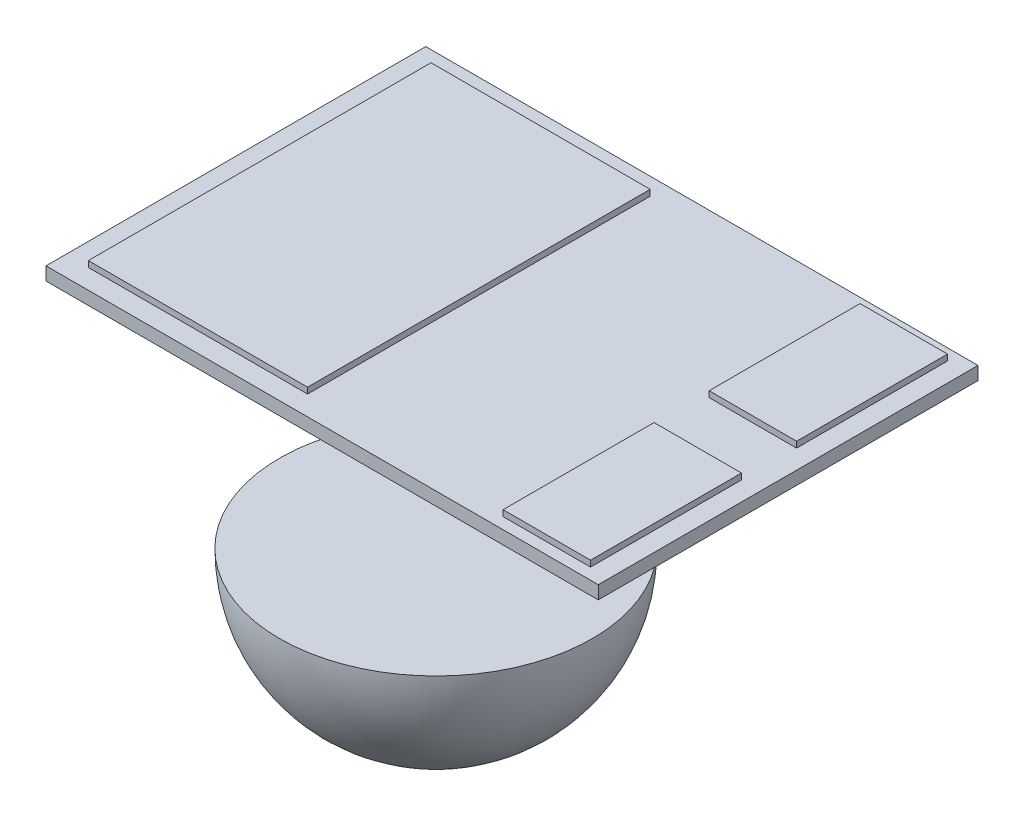
ISO-10303-21;
HEADER;
FILE_DESCRIPTION(('STEP AP214'),'2;1');
FILE_NAME('part.step','',(''),(''),'','','');
FILE_SCHEMA(('AUTOMOTIVE_DESIGN { 1 0 10303 214 1 1 1 1 }'));
ENDSEC;
DATA;
#1=APPLICATION_CONTEXT('core data for automotive mechanical design processes');
#2=APPLICATION_PROTOCOL_DEFINITION('international standard','automotive_design',2000,#1);
#3=PRODUCT_CONTEXT('',#1,'mechanical');
#4=PRODUCT('Part','Part','',(#3));
#5=PRODUCT_RELATED_PRODUCT_CATEGORY('part','',(#4));
#6=PRODUCT_DEFINITION_FORMATION('','',#4);
#7=PRODUCT_DEFINITION_CONTEXT('part definition',#1,'design');
#8=PRODUCT_DEFINITION('design','',#6,#7);
#9=PRODUCT_DEFINITION_SHAPE('','',#8);
#10=(LENGTH_UNIT() NAMED_UNIT(*) SI_UNIT(.MILLI.,.METRE.));
#11=(NAMED_UNIT(*) PLANE_ANGLE_UNIT() SI_UNIT($,.RADIAN.));
#12=(NAMED_UNIT(*) SI_UNIT($,.STERADIAN.) SOLID_ANGLE_UNIT());
#13=UNCERTAINTY_MEASURE_WITH_UNIT(LENGTH_MEASURE(1.E-05),#10,'distance_accuracy_value','');
#14=(GEOMETRIC_REPRESENTATION_CONTEXT(3) GLOBAL_UNCERTAINTY_ASSIGNED_CONTEXT((#13)) GLOBAL_UNIT_ASSIGNED_CONTEXT((#10,
#11,#12)) REPRESENTATION_CONTEXT('',''));
#15=CARTESIAN_POINT('',(0.,0.,0.));
#16=DIRECTION('',(0.,0.,1.));
#17=DIRECTION('',(1.,0.,0.));
#18=AXIS2_PLACEMENT_3D('',#15,#16,#17);
#19=CARTESIAN_POINT('',(-0.122417232417999,-1.89,0.));
#20=DIRECTION('',(0.,0.,-1.));
#21=DIRECTION('',(-1.,0.,0.));
#22=AXIS2_PLACEMENT_3D('',#19,#20,#21);
#23=SPHERICAL_SURFACE('',#22,1.305);
#24=CARTESIAN_POINT('',(-0.122417232417999,-1.89,0.));
#25=DIRECTION('',(0.,1.,0.));
#26=DIRECTION('',(0.,0.,1.));
#27=AXIS2_PLACEMENT_3D('',#24,#25,#26);
#28=SPHERICAL_SURFACE('',#27,1.305);
#29=CARTESIAN_POINT('',(-0.122417232417999,-1.89,0.));
#30=DIRECTION('',(0.,1.,0.));
#31=DIRECTION('',(0.,0.,1.));
#32=AXIS2_PLACEMENT_3D('',#29,#30,#31);
#33=CIRCLE('',#32,1.305);
#34=CARTESIAN_POINT('',(-0.122417232417998,-1.89,1.305));
#35=VERTEX_POINT('',#34);
#36=EDGE_CURVE('E11',#35,#35,#33,.T.);
#37=ORIENTED_EDGE('',*,*,#36,.F.);
#38=EDGE_LOOP('',(#37));
#39=FACE_BOUND('',#38,.T.);
#40=ADVANCED_FACE('F43',(#39),#28,.T.);
#41=CARTESIAN_POINT('',(-0.122417232417999,-1.89,0.));
#42=DIRECTION('',(0.,-1.,0.));
#43=DIRECTION('',(0.,0.,1.));
#44=AXIS2_PLACEMENT_3D('',#41,#42,#43);
#45=PLANE('',#44);
#46=ORIENTED_EDGE('',*,*,#36,.T.);
#47=EDGE_LOOP('',(#46));
#48=FACE_BOUND('',#47,.T.);
#49=ADVANCED_FACE('F50',(#48),#45,.F.);
#50=CLOSED_SHELL('',(#40,#49));
#51=MANIFOLD_SOLID_BREP('B2',#50);
#52=CARTESIAN_POINT('',(0.,0.11,0.));
#53=DIRECTION('',(0.,1.,0.));
#54=DIRECTION('',(0.,0.,1.));
#55=AXIS2_PLACEMENT_3D('',#52,#53,#54);
#56=PLANE('',#55);
#57=DIRECTION('',(0.,0.,1.));
#58=VECTOR('',#57,1.);
#59=CARTESIAN_POINT('',(-1.792417232418,0.11,-1.585));
#60=LINE('',#59,#58);
#61=CARTESIAN_POINT('',(-1.792417232418,0.11,-1.585));
#62=VERTEX_POINT('',#61);
#63=CARTESIAN_POINT('',(-1.792417232418,0.11,1.585));
#64=VERTEX_POINT('',#63);
#65=EDGE_CURVE('E287',#62,#64,#60,.T.);
#66=ORIENTED_EDGE('',*,*,#65,.T.);
#67=DIRECTION('',(1.,0.,0.));
#68=VECTOR('',#67,1.);
#69=CARTESIAN_POINT('',(-1.792417232418,0.11,1.585));
#70=LINE('',#69,#68);
#71=CARTESIAN_POINT('',(2.817582767582,0.11,1.585));
#72=VERTEX_POINT('',#71);
#73=EDGE_CURVE('E290',#64,#72,#70,.T.);
#74=ORIENTED_EDGE('',*,*,#73,.T.);
#75=DIRECTION('',(0.,0.,-1.));
#76=VECTOR('',#75,1.);
#77=CARTESIAN_POINT('',(2.817582767582,0.11,-1.585));
#78=LINE('',#77,#76);
#79=CARTESIAN_POINT('',(2.817582767582,0.11,-1.585));
#80=VERTEX_POINT('',#79);
#81=EDGE_CURVE('E293',#72,#80,#78,.T.);
#82=ORIENTED_EDGE('',*,*,#81,.T.);
#83=DIRECTION('',(-1.,0.,0.));
#84=VECTOR('',#83,1.);
#85=CARTESIAN_POINT('',(-1.792417232418,0.11,-1.585));
#86=LINE('',#85,#84);
#87=EDGE_CURVE('E295',#80,#62,#86,.T.);
#88=ORIENTED_EDGE('',*,*,#87,.T.);
#89=EDGE_LOOP('',(#66,#74,#82,#88));
#90=FACE_BOUND('',#89,.T.);
#91=DIRECTION('',(-1.,0.,0.));
#92=VECTOR('',#91,1.);
#93=CARTESIAN_POINT('',(0.,0.11,1.42));
#94=LINE('',#93,#92);
#95=CARTESIAN_POINT('',(0.226309506285606,0.11,1.42));
#96=VERTEX_POINT('',#95);
#97=CARTESIAN_POINT('',(-1.60369049371439,0.11,1.42));
#98=VERTEX_POINT('',#97);
#99=EDGE_CURVE('E280',#96,#98,#94,.T.);
#100=ORIENTED_EDGE('',*,*,#99,.T.);
#101=DIRECTION('',(0.,0.,-1.));
#102=VECTOR('',#101,1.);
#103=CARTESIAN_POINT('',(-1.60369049371439,0.11,0.));
#104=LINE('',#103,#102);
#105=CARTESIAN_POINT('',(-1.60369049371439,0.11,-1.44));
#106=VERTEX_POINT('',#105);
#107=EDGE_CURVE('E283',#98,#106,#104,.T.);
#108=ORIENTED_EDGE('',*,*,#107,.T.);
#109=DIRECTION('',(1.,0.,0.));
#110=VECTOR('',#109,1.);
#111=CARTESIAN_POINT('',(0.,0.11,-1.44));
#112=LINE('',#111,#110);
#113=CARTESIAN_POINT('',(0.226309506285606,0.11,-1.44));
#114=VERTEX_POINT('',#113);
#115=EDGE_CURVE('E274',#106,#114,#112,.T.);
#116=ORIENTED_EDGE('',*,*,#115,.T.);
#117=DIRECTION('',(0.,0.,1.));
#118=VECTOR('',#117,1.);
#119=CARTESIAN_POINT('',(0.226309506285606,0.11,0.));
#120=LINE('',#119,#118);
#121=EDGE_CURVE('E277',#114,#96,#120,.T.);
#122=ORIENTED_EDGE('',*,*,#121,.T.);
#123=EDGE_LOOP('',(#100,#108,#116,#122));
#124=FACE_BOUND('',#123,.T.);
#125=DIRECTION('',(-1.,0.,0.));
#126=VECTOR('',#125,1.);
#127=CARTESIAN_POINT('',(0.,0.11,-0.23));
#128=LINE('',#127,#126);
#129=CARTESIAN_POINT('',(2.65814872562951,0.11,-0.23));
#130=VERTEX_POINT('',#129);
#131=CARTESIAN_POINT('',(1.92814872562951,0.11,-0.23));
#132=VERTEX_POINT('',#131);
#133=EDGE_CURVE('E248',#130,#132,#128,.T.);
#134=ORIENTED_EDGE('',*,*,#133,.T.);
#135=DIRECTION('',(0.,0.,-1.));
#136=VECTOR('',#135,1.);
#137=CARTESIAN_POINT('',(1.92814872562951,0.11,0.));
#138=LINE('',#137,#136);
#139=CARTESIAN_POINT('',(1.92814872562951,0.11,-1.49));
#140=VERTEX_POINT('',#139);
#141=EDGE_CURVE('E251',#132,#140,#138,.T.);
#142=ORIENTED_EDGE('',*,*,#141,.T.);
#143=DIRECTION('',(1.,0.,0.));
#144=VECTOR('',#143,1.);
#145=CARTESIAN_POINT('',(0.,0.11,-1.49));
#146=LINE('',#145,#144);
#147=CARTESIAN_POINT('',(2.65814872562951,0.11,-1.49));
#148=VERTEX_POINT('',#147);
#149=EDGE_CURVE('E242',#140,#148,#146,.T.);
#150=ORIENTED_EDGE('',*,*,#149,.T.);
#151=DIRECTION('',(0.,0.,1.));
#152=VECTOR('',#151,1.);
#153=CARTESIAN_POINT('',(2.65814872562951,0.11,0.));
#154=LINE('',#153,#152);
#155=EDGE_CURVE('E245',#148,#130,#154,.T.);
#156=ORIENTED_EDGE('',*,*,#155,.T.);
#157=EDGE_LOOP('',(#134,#142,#150,#156));
#158=FACE_BOUND('',#157,.T.);
#159=DIRECTION('',(-1.,0.,0.));
#160=VECTOR('',#159,1.);
#161=CARTESIAN_POINT('',(0.,0.11,1.49));
#162=LINE('',#161,#160);
#163=CARTESIAN_POINT('',(2.65814872562951,0.11,1.49));
#164=VERTEX_POINT('',#163);
#165=CARTESIAN_POINT('',(1.92814872562951,0.11,1.49));
#166=VERTEX_POINT('',#165);
#167=EDGE_CURVE('E220',#164,#166,#162,.T.);
#168=ORIENTED_EDGE('',*,*,#167,.T.);
#169=DIRECTION('',(0.,0.,-1.));
#170=VECTOR('',#169,1.);
#171=CARTESIAN_POINT('',(1.92814872562951,0.11,0.));
#172=LINE('',#171,#170);
#173=CARTESIAN_POINT('',(1.92814872562951,0.11,0.23));
#174=VERTEX_POINT('',#173);
#175=EDGE_CURVE('E209',#166,#174,#172,.T.);
#176=ORIENTED_EDGE('',*,*,#175,.T.);
#177=DIRECTION('',(1.,0.,0.));
#178=VECTOR('',#177,1.);
#179=CARTESIAN_POINT('',(0.,0.11,0.23));
#180=LINE('',#179,#178);
#181=CARTESIAN_POINT('',(2.65814872562951,0.11,0.23));
#182=VERTEX_POINT('',#181);
#183=EDGE_CURVE('E210',#174,#182,#180,.T.);
#184=ORIENTED_EDGE('',*,*,#183,.T.);
#185=DIRECTION('',(0.,0.,1.));
#186=VECTOR('',#185,1.);
#187=CARTESIAN_POINT('',(2.65814872562951,0.11,0.));
#188=LINE('',#187,#186);
#189=EDGE_CURVE('E213',#182,#164,#188,.T.);
#190=ORIENTED_EDGE('',*,*,#189,.T.);
#191=EDGE_LOOP('',(#168,#176,#184,#190));
#192=FACE_BOUND('',#191,.T.);
#193=ADVANCED_FACE('F72',(#90,#124,#158,#192),#56,.T.);
#194=CARTESIAN_POINT('',(-1.792417232418,0.11,-1.585));
#195=DIRECTION('',(1.,0.,0.));
#196=DIRECTION('',(0.,0.,-1.));
#197=AXIS2_PLACEMENT_3D('',#194,#195,#196);
#198=PLANE('',#197);
#199=DIRECTION('',(0.,0.,1.));
#200=VECTOR('',#199,1.);
#201=CARTESIAN_POINT('',(-1.792417232418,0.,-1.585));
#202=LINE('',#201,#200);
#203=CARTESIAN_POINT('',(-1.792417232418,0.,-1.585));
#204=VERTEX_POINT('',#203);
#205=CARTESIAN_POINT('',(-1.792417232418,0.,1.585));
#206=VERTEX_POINT('',#205);
#207=EDGE_CURVE('E286',#204,#206,#202,.T.);
#208=ORIENTED_EDGE('',*,*,#207,.T.);
#209=DIRECTION('',(0.,-1.,0.));
#210=VECTOR('',#209,1.);
#211=CARTESIAN_POINT('',(-1.792417232418,0.11,1.585));
#212=LINE('',#211,#210);
#213=EDGE_CURVE('E41',#64,#206,#212,.T.);
#214=ORIENTED_EDGE('',*,*,#213,.F.);
#215=ORIENTED_EDGE('',*,*,#65,.F.);
#216=DIRECTION('',(0.,-1.,0.));
#217=VECTOR('',#216,1.);
#218=CARTESIAN_POINT('',(-1.792417232418,0.11,-1.585));
#219=LINE('',#218,#217);
#220=EDGE_CURVE('E297',#62,#204,#219,.T.);
#221=ORIENTED_EDGE('',*,*,#220,.T.);
#222=EDGE_LOOP('',(#208,#214,#215,#221));
#223=FACE_BOUND('',#222,.T.);
#224=ADVANCED_FACE('F74',(#223),#198,.F.);
#225=CARTESIAN_POINT('',(-1.792417232418,0.11,1.585));
#226=DIRECTION('',(0.,0.,-1.));
#227=DIRECTION('',(-1.,0.,0.));
#228=AXIS2_PLACEMENT_3D('',#225,#226,#227);
#229=PLANE('',#228);
#230=DIRECTION('',(1.,0.,0.));
#231=VECTOR('',#230,1.);
#232=CARTESIAN_POINT('',(-1.792417232418,0.,1.585));
#233=LINE('',#232,#231);
#234=CARTESIAN_POINT('',(2.817582767582,0.,1.585));
#235=VERTEX_POINT('',#234);
#236=EDGE_CURVE('E300',#206,#235,#233,.T.);
#237=ORIENTED_EDGE('',*,*,#236,.T.);
#238=DIRECTION('',(0.,-1.,0.));
#239=VECTOR('',#238,1.);
#240=CARTESIAN_POINT('',(2.817582767582,0.11,1.585));
#241=LINE('',#240,#239);
#242=EDGE_CURVE('E80',#72,#235,#241,.T.);
#243=ORIENTED_EDGE('',*,*,#242,.F.);
#244=ORIENTED_EDGE('',*,*,#73,.F.);
#245=ORIENTED_EDGE('',*,*,#213,.T.);
#246=EDGE_LOOP('',(#237,#243,#244,#245));
#247=FACE_BOUND('',#246,.T.);
#248=ADVANCED_FACE('F330',(#247),#229,.F.);
#249=CARTESIAN_POINT('',(2.817582767582,0.11,-1.585));
#250=DIRECTION('',(-1.,0.,0.));
#251=DIRECTION('',(0.,0.,1.));
#252=AXIS2_PLACEMENT_3D('',#249,#250,#251);
#253=PLANE('',#252);
#254=DIRECTION('',(0.,0.,-1.));
#255=VECTOR('',#254,1.);
#256=CARTESIAN_POINT('',(2.817582767582,0.,-1.585));
#257=LINE('',#256,#255);
#258=CARTESIAN_POINT('',(2.817582767582,0.,-1.585));
#259=VERTEX_POINT('',#258);
#260=EDGE_CURVE('E302',#235,#259,#257,.T.);
#261=ORIENTED_EDGE('',*,*,#260,.T.);
#262=DIRECTION('',(0.,-1.,0.));
#263=VECTOR('',#262,1.);
#264=CARTESIAN_POINT('',(2.817582767582,0.11,-1.585));
#265=LINE('',#264,#263);
#266=EDGE_CURVE('E307',#80,#259,#265,.T.);
#267=ORIENTED_EDGE('',*,*,#266,.F.);
#268=ORIENTED_EDGE('',*,*,#81,.F.);
#269=ORIENTED_EDGE('',*,*,#242,.T.);
#270=EDGE_LOOP('',(#261,#267,#268,#269));
#271=FACE_BOUND('',#270,.T.);
#272=ADVANCED_FACE('F314',(#271),#253,.F.);
#273=CARTESIAN_POINT('',(-1.792417232418,0.11,-1.585));
#274=DIRECTION('',(0.,0.,1.));
#275=DIRECTION('',(1.,0.,0.));
#276=AXIS2_PLACEMENT_3D('',#273,#274,#275);
#277=PLANE('',#276);
#278=DIRECTION('',(-1.,0.,0.));
#279=VECTOR('',#278,1.);
#280=CARTESIAN_POINT('',(-1.792417232418,0.,-1.585));
#281=LINE('',#280,#279);
#282=EDGE_CURVE('E291',#259,#204,#281,.T.);
#283=ORIENTED_EDGE('',*,*,#282,.T.);
#284=ORIENTED_EDGE('',*,*,#220,.F.);
#285=ORIENTED_EDGE('',*,*,#87,.F.);
#286=ORIENTED_EDGE('',*,*,#266,.T.);
#287=EDGE_LOOP('',(#283,#284,#285,#286));
#288=FACE_BOUND('',#287,.T.);
#289=ADVANCED_FACE('F323',(#288),#277,.F.);
#290=CARTESIAN_POINT('',(0.,0.,0.));
#291=DIRECTION('',(0.,1.,0.));
#292=DIRECTION('',(0.,0.,1.));
#293=AXIS2_PLACEMENT_3D('',#290,#291,#292);
#294=PLANE('',#293);
#295=ORIENTED_EDGE('',*,*,#207,.F.);
#296=ORIENTED_EDGE('',*,*,#282,.F.);
#297=ORIENTED_EDGE('',*,*,#260,.F.);
#298=ORIENTED_EDGE('',*,*,#236,.F.);
#299=EDGE_LOOP('',(#295,#296,#297,#298));
#300=FACE_BOUND('',#299,.T.);
#301=ADVANCED_FACE('F320',(#300),#294,.F.);
#302=CARTESIAN_POINT('',(-1.60369049371439,0.16,-1.44));
#303=DIRECTION('',(1.,0.,0.));
#304=DIRECTION('',(0.,0.,-1.));
#305=AXIS2_PLACEMENT_3D('',#302,#303,#304);
#306=PLANE('',#305);
#307=ORIENTED_EDGE('',*,*,#107,.F.);
#308=DIRECTION('',(0.,-1.,0.));
#309=VECTOR('',#308,1.);
#310=CARTESIAN_POINT('',(-1.60369049371439,0.16,1.42));
#311=LINE('',#310,#309);
#312=CARTESIAN_POINT('',(-1.60369049371439,0.16,1.42));
#313=VERTEX_POINT('',#312);
#314=EDGE_CURVE('E271',#313,#98,#311,.T.);
#315=ORIENTED_EDGE('',*,*,#314,.F.);
#316=DIRECTION('',(0.,0.,1.));
#317=VECTOR('',#316,1.);
#318=CARTESIAN_POINT('',(-1.60369049371439,0.16,-1.44));
#319=LINE('',#318,#317);
#320=CARTESIAN_POINT('',(-1.60369049371439,0.16,-1.44));
#321=VERTEX_POINT('',#320);
#322=EDGE_CURVE('E254',#321,#313,#319,.T.);
#323=ORIENTED_EDGE('',*,*,#322,.F.);
#324=DIRECTION('',(0.,-1.,0.));
#325=VECTOR('',#324,1.);
#326=CARTESIAN_POINT('',(-1.60369049371439,0.16,-1.44));
#327=LINE('',#326,#325);
#328=EDGE_CURVE('E263',#321,#106,#327,.T.);
#329=ORIENTED_EDGE('',*,*,#328,.T.);
#330=EDGE_LOOP('',(#307,#315,#323,#329));
#331=FACE_BOUND('',#330,.T.);
#332=ADVANCED_FACE('F343',(#331),#306,.F.);
#333=CARTESIAN_POINT('',(-1.60369049371439,0.16,1.42));
#334=DIRECTION('',(0.,0.,-1.));
#335=DIRECTION('',(-1.,0.,0.));
#336=AXIS2_PLACEMENT_3D('',#333,#334,#335);
#337=PLANE('',#336);
#338=ORIENTED_EDGE('',*,*,#99,.F.);
#339=DIRECTION('',(0.,-1.,0.));
#340=VECTOR('',#339,1.);
#341=CARTESIAN_POINT('',(0.226309506285606,0.16,1.42));
#342=LINE('',#341,#340);
#343=CARTESIAN_POINT('',(0.226309506285606,0.16,1.42));
#344=VERTEX_POINT('',#343);
#345=EDGE_CURVE('E268',#344,#96,#342,.T.);
#346=ORIENTED_EDGE('',*,*,#345,.F.);
#347=DIRECTION('',(1.,0.,0.));
#348=VECTOR('',#347,1.);
#349=CARTESIAN_POINT('',(-1.60369049371439,0.16,1.42));
#350=LINE('',#349,#348);
#351=EDGE_CURVE('E257',#313,#344,#350,.T.);
#352=ORIENTED_EDGE('',*,*,#351,.F.);
#353=ORIENTED_EDGE('',*,*,#314,.T.);
#354=EDGE_LOOP('',(#338,#346,#352,#353));
#355=FACE_BOUND('',#354,.T.);
#356=ADVANCED_FACE('F363',(#355),#337,.F.);
#357=CARTESIAN_POINT('',(0.226309506285606,0.16,-1.44));
#358=DIRECTION('',(-1.,0.,0.));
#359=DIRECTION('',(0.,0.,1.));
#360=AXIS2_PLACEMENT_3D('',#357,#358,#359);
#361=PLANE('',#360);
#362=ORIENTED_EDGE('',*,*,#121,.F.);
#363=DIRECTION('',(0.,-1.,0.));
#364=VECTOR('',#363,1.);
#365=CARTESIAN_POINT('',(0.226309506285606,0.16,-1.44));
#366=LINE('',#365,#364);
#367=CARTESIAN_POINT('',(0.226309506285606,0.16,-1.44));
#368=VERTEX_POINT('',#367);
#369=EDGE_CURVE('E266',#368,#114,#366,.T.);
#370=ORIENTED_EDGE('',*,*,#369,.F.);
#371=DIRECTION('',(0.,0.,-1.));
#372=VECTOR('',#371,1.);
#373=CARTESIAN_POINT('',(0.226309506285606,0.16,-1.44));
#374=LINE('',#373,#372);
#375=EDGE_CURVE('E259',#344,#368,#374,.T.);
#376=ORIENTED_EDGE('',*,*,#375,.F.);
#377=ORIENTED_EDGE('',*,*,#345,.T.);
#378=EDGE_LOOP('',(#362,#370,#376,#377));
#379=FACE_BOUND('',#378,.T.);
#380=ADVANCED_FACE('F370',(#379),#361,.F.);
#381=CARTESIAN_POINT('',(-1.60369049371439,0.16,-1.44));
#382=DIRECTION('',(0.,0.,1.));
#383=DIRECTION('',(1.,0.,0.));
#384=AXIS2_PLACEMENT_3D('',#381,#382,#383);
#385=PLANE('',#384);
#386=ORIENTED_EDGE('',*,*,#115,.F.);
#387=ORIENTED_EDGE('',*,*,#328,.F.);
#388=DIRECTION('',(-1.,0.,0.));
#389=VECTOR('',#388,1.);
#390=CARTESIAN_POINT('',(-1.60369049371439,0.16,-1.44));
#391=LINE('',#390,#389);
#392=EDGE_CURVE('E261',#368,#321,#391,.T.);
#393=ORIENTED_EDGE('',*,*,#392,.F.);
#394=ORIENTED_EDGE('',*,*,#369,.T.);
#395=EDGE_LOOP('',(#386,#387,#393,#394));
#396=FACE_BOUND('',#395,.T.);
#397=ADVANCED_FACE('F377',(#396),#385,.F.);
#398=CARTESIAN_POINT('',(0.,0.16,0.));
#399=DIRECTION('',(0.,1.,0.));
#400=DIRECTION('',(0.,0.,1.));
#401=AXIS2_PLACEMENT_3D('',#398,#399,#400);
#402=PLANE('',#401);
#403=ORIENTED_EDGE('',*,*,#322,.T.);
#404=ORIENTED_EDGE('',*,*,#351,.T.);
#405=ORIENTED_EDGE('',*,*,#375,.T.);
#406=ORIENTED_EDGE('',*,*,#392,.T.);
#407=EDGE_LOOP('',(#403,#404,#405,#406));
#408=FACE_BOUND('',#407,.T.);
#409=ADVANCED_FACE('F385',(#408),#402,.T.);
#410=CARTESIAN_POINT('',(1.92814872562951,0.16,-1.49));
#411=DIRECTION('',(1.,0.,0.));
#412=DIRECTION('',(0.,0.,-1.));
#413=AXIS2_PLACEMENT_3D('',#410,#411,#412);
#414=PLANE('',#413);
#415=ORIENTED_EDGE('',*,*,#141,.F.);
#416=DIRECTION('',(0.,-1.,0.));
#417=VECTOR('',#416,1.);
#418=CARTESIAN_POINT('',(1.92814872562951,0.16,-0.23));
#419=LINE('',#418,#417);
#420=CARTESIAN_POINT('',(1.92814872562951,0.16,-0.23));
#421=VERTEX_POINT('',#420);
#422=EDGE_CURVE('E239',#421,#132,#419,.T.);
#423=ORIENTED_EDGE('',*,*,#422,.F.);
#424=DIRECTION('',(0.,0.,1.));
#425=VECTOR('',#424,1.);
#426=CARTESIAN_POINT('',(1.92814872562951,0.16,-1.49));
#427=LINE('',#426,#425);
#428=CARTESIAN_POINT('',(1.92814872562951,0.16,-1.49));
#429=VERTEX_POINT('',#428);
#430=EDGE_CURVE('E223',#429,#421,#427,.T.);
#431=ORIENTED_EDGE('',*,*,#430,.F.);
#432=DIRECTION('',(0.,-1.,0.));
#433=VECTOR('',#432,1.);
#434=CARTESIAN_POINT('',(1.92814872562951,0.16,-1.49));
#435=LINE('',#434,#433);
#436=EDGE_CURVE('E232',#429,#140,#435,.T.);
#437=ORIENTED_EDGE('',*,*,#436,.T.);
#438=EDGE_LOOP('',(#415,#423,#431,#437));
#439=FACE_BOUND('',#438,.T.);
#440=ADVANCED_FACE('F393',(#439),#414,.F.);
#441=CARTESIAN_POINT('',(1.92814872562951,0.16,-0.23));
#442=DIRECTION('',(0.,0.,-1.));
#443=DIRECTION('',(-1.,0.,0.));
#444=AXIS2_PLACEMENT_3D('',#441,#442,#443);
#445=PLANE('',#444);
#446=ORIENTED_EDGE('',*,*,#133,.F.);
#447=DIRECTION('',(0.,-1.,0.));
#448=VECTOR('',#447,1.);
#449=CARTESIAN_POINT('',(2.65814872562951,0.16,-0.23));
#450=LINE('',#449,#448);
#451=CARTESIAN_POINT('',(2.65814872562951,0.16,-0.23));
#452=VERTEX_POINT('',#451);
#453=EDGE_CURVE('E236',#452,#130,#450,.T.);
#454=ORIENTED_EDGE('',*,*,#453,.F.);
#455=DIRECTION('',(1.,0.,0.));
#456=VECTOR('',#455,1.);
#457=CARTESIAN_POINT('',(1.92814872562951,0.16,-0.23));
#458=LINE('',#457,#456);
#459=EDGE_CURVE('E226',#421,#452,#458,.T.);
#460=ORIENTED_EDGE('',*,*,#459,.F.);
#461=ORIENTED_EDGE('',*,*,#422,.T.);
#462=EDGE_LOOP('',(#446,#454,#460,#461));
#463=FACE_BOUND('',#462,.T.);
#464=ADVANCED_FACE('F400',(#463),#445,.F.);
#465=CARTESIAN_POINT('',(2.65814872562951,0.16,-1.49));
#466=DIRECTION('',(-1.,0.,0.));
#467=DIRECTION('',(0.,0.,1.));
#468=AXIS2_PLACEMENT_3D('',#465,#466,#467);
#469=PLANE('',#468);
#470=ORIENTED_EDGE('',*,*,#155,.F.);
#471=DIRECTION('',(0.,-1.,0.));
#472=VECTOR('',#471,1.);
#473=CARTESIAN_POINT('',(2.65814872562951,0.16,-1.49));
#474=LINE('',#473,#472);
#475=CARTESIAN_POINT('',(2.65814872562951,0.16,-1.49));
#476=VERTEX_POINT('',#475);
#477=EDGE_CURVE('E95',#476,#148,#474,.T.);
#478=ORIENTED_EDGE('',*,*,#477,.F.);
#479=DIRECTION('',(0.,0.,-1.));
#480=VECTOR('',#479,1.);
#481=CARTESIAN_POINT('',(2.65814872562951,0.16,-1.49));
#482=LINE('',#481,#480);
#483=EDGE_CURVE('E228',#452,#476,#482,.T.);
#484=ORIENTED_EDGE('',*,*,#483,.F.);
#485=ORIENTED_EDGE('',*,*,#453,.T.);
#486=EDGE_LOOP('',(#470,#478,#484,#485));
#487=FACE_BOUND('',#486,.T.);
#488=ADVANCED_FACE('F408',(#487),#469,.F.);
#489=CARTESIAN_POINT('',(1.92814872562951,0.16,-1.49));
#490=DIRECTION('',(0.,0.,1.));
#491=DIRECTION('',(1.,0.,0.));
#492=AXIS2_PLACEMENT_3D('',#489,#490,#491);
#493=PLANE('',#492);
#494=ORIENTED_EDGE('',*,*,#149,.F.);
#495=ORIENTED_EDGE('',*,*,#436,.F.);
#496=DIRECTION('',(-1.,0.,0.));
#497=VECTOR('',#496,1.);
#498=CARTESIAN_POINT('',(1.92814872562951,0.16,-1.49));
#499=LINE('',#498,#497);
#500=EDGE_CURVE('E230',#476,#429,#499,.T.);
#501=ORIENTED_EDGE('',*,*,#500,.F.);
#502=ORIENTED_EDGE('',*,*,#477,.T.);
#503=EDGE_LOOP('',(#494,#495,#501,#502));
#504=FACE_BOUND('',#503,.T.);
#505=ADVANCED_FACE('F416',(#504),#493,.F.);
#506=CARTESIAN_POINT('',(0.,0.16,0.));
#507=DIRECTION('',(0.,1.,0.));
#508=DIRECTION('',(0.,0.,1.));
#509=AXIS2_PLACEMENT_3D('',#506,#507,#508);
#510=PLANE('',#509);
#511=ORIENTED_EDGE('',*,*,#430,.T.);
#512=ORIENTED_EDGE('',*,*,#459,.T.);
#513=ORIENTED_EDGE('',*,*,#483,.T.);
#514=ORIENTED_EDGE('',*,*,#500,.T.);
#515=EDGE_LOOP('',(#511,#512,#513,#514));
#516=FACE_BOUND('',#515,.T.);
#517=ADVANCED_FACE('F424',(#516),#510,.T.);
#518=CARTESIAN_POINT('',(1.92814872562951,0.16,0.23));
#519=DIRECTION('',(1.,0.,0.));
#520=DIRECTION('',(0.,0.,-1.));
#521=AXIS2_PLACEMENT_3D('',#518,#519,#520);
#522=PLANE('',#521);
#523=ORIENTED_EDGE('',*,*,#175,.F.);
#524=DIRECTION('',(0.,-1.,0.));
#525=VECTOR('',#524,1.);
#526=CARTESIAN_POINT('',(1.92814872562951,0.16,1.49));
#527=LINE('',#526,#525);
#528=CARTESIAN_POINT('',(1.92814872562951,0.16,1.49));
#529=VERTEX_POINT('',#528);
#530=EDGE_CURVE('E191',#529,#166,#527,.T.);
#531=ORIENTED_EDGE('',*,*,#530,.F.);
#532=DIRECTION('',(0.,0.,1.));
#533=VECTOR('',#532,1.);
#534=CARTESIAN_POINT('',(1.92814872562951,0.16,0.23));
#535=LINE('',#534,#533);
#536=CARTESIAN_POINT('',(1.92814872562951,0.16,0.23));
#537=VERTEX_POINT('',#536);
#538=EDGE_CURVE('E198',#537,#529,#535,.T.);
#539=ORIENTED_EDGE('',*,*,#538,.F.);
#540=DIRECTION('',(0.,-1.,0.));
#541=VECTOR('',#540,1.);
#542=CARTESIAN_POINT('',(1.92814872562951,0.16,0.23));
#543=LINE('',#542,#541);
#544=EDGE_CURVE('E519',#537,#174,#543,.T.);
#545=ORIENTED_EDGE('',*,*,#544,.T.);
#546=EDGE_LOOP('',(#523,#531,#539,#545));
#547=FACE_BOUND('',#546,.T.);
#548=ADVANCED_FACE('F207',(#547),#522,.F.);
#549=CARTESIAN_POINT('',(1.92814872562951,0.16,1.49));
#550=DIRECTION('',(0.,0.,-1.));
#551=DIRECTION('',(-1.,0.,0.));
#552=AXIS2_PLACEMENT_3D('',#549,#550,#551);
#553=PLANE('',#552);
#554=ORIENTED_EDGE('',*,*,#167,.F.);
#555=DIRECTION('',(0.,-1.,0.));
#556=VECTOR('',#555,1.);
#557=CARTESIAN_POINT('',(2.65814872562951,0.16,1.49));
#558=LINE('',#557,#556);
#559=CARTESIAN_POINT('',(2.65814872562951,0.16,1.49));
#560=VERTEX_POINT('',#559);
#561=EDGE_CURVE('E194',#560,#164,#558,.T.);
#562=ORIENTED_EDGE('',*,*,#561,.F.);
#563=DIRECTION('',(1.,0.,0.));
#564=VECTOR('',#563,1.);
#565=CARTESIAN_POINT('',(1.92814872562951,0.16,1.49));
#566=LINE('',#565,#564);
#567=EDGE_CURVE('E187',#529,#560,#566,.T.);
#568=ORIENTED_EDGE('',*,*,#567,.F.);
#569=ORIENTED_EDGE('',*,*,#530,.T.);
#570=EDGE_LOOP('',(#554,#562,#568,#569));
#571=FACE_BOUND('',#570,.T.);
#572=ADVANCED_FACE('F189',(#571),#553,.F.);
#573=CARTESIAN_POINT('',(2.65814872562951,0.16,0.23));
#574=DIRECTION('',(-1.,0.,0.));
#575=DIRECTION('',(0.,0.,1.));
#576=AXIS2_PLACEMENT_3D('',#573,#574,#575);
#577=PLANE('',#576);
#578=ORIENTED_EDGE('',*,*,#189,.F.);
#579=DIRECTION('',(0.,-1.,0.));
#580=VECTOR('',#579,1.);
#581=CARTESIAN_POINT('',(2.65814872562951,0.16,0.23));
#582=LINE('',#581,#580);
#583=CARTESIAN_POINT('',(2.65814872562951,0.16,0.23));
#584=VERTEX_POINT('',#583);
#585=EDGE_CURVE('E87',#584,#182,#582,.T.);
#586=ORIENTED_EDGE('',*,*,#585,.F.);
#587=DIRECTION('',(0.,0.,-1.));
#588=VECTOR('',#587,1.);
#589=CARTESIAN_POINT('',(2.65814872562951,0.16,0.23));
#590=LINE('',#589,#588);
#591=EDGE_CURVE('E197',#560,#584,#590,.T.);
#592=ORIENTED_EDGE('',*,*,#591,.F.);
#593=ORIENTED_EDGE('',*,*,#561,.T.);
#594=EDGE_LOOP('',(#578,#586,#592,#593));
#595=FACE_BOUND('',#594,.T.);
#596=ADVANCED_FACE('F444',(#595),#577,.F.);
#597=CARTESIAN_POINT('',(1.92814872562951,0.16,0.23));
#598=DIRECTION('',(0.,0.,1.));
#599=DIRECTION('',(1.,0.,0.));
#600=AXIS2_PLACEMENT_3D('',#597,#598,#599);
#601=PLANE('',#600);
#602=ORIENTED_EDGE('',*,*,#183,.F.);
#603=ORIENTED_EDGE('',*,*,#544,.F.);
#604=DIRECTION('',(-1.,0.,0.));
#605=VECTOR('',#604,1.);
#606=CARTESIAN_POINT('',(1.92814872562951,0.16,0.23));
#607=LINE('',#606,#605);
#608=EDGE_CURVE('E202',#584,#537,#607,.T.);
#609=ORIENTED_EDGE('',*,*,#608,.F.);
#610=ORIENTED_EDGE('',*,*,#585,.T.);
#611=EDGE_LOOP('',(#602,#603,#609,#610));
#612=FACE_BOUND('',#611,.T.);
#613=ADVANCED_FACE('F451',(#612),#601,.F.);
#614=CARTESIAN_POINT('',(0.,0.16,0.));
#615=DIRECTION('',(0.,1.,0.));
#616=DIRECTION('',(0.,0.,1.));
#617=AXIS2_PLACEMENT_3D('',#614,#615,#616);
#618=PLANE('',#617);
#619=ORIENTED_EDGE('',*,*,#538,.T.);
#620=ORIENTED_EDGE('',*,*,#567,.T.);
#621=ORIENTED_EDGE('',*,*,#591,.T.);
#622=ORIENTED_EDGE('',*,*,#608,.T.);
#623=EDGE_LOOP('',(#619,#620,#621,#622));
#624=FACE_BOUND('',#623,.T.);
#625=ADVANCED_FACE('F201',(#624),#618,.T.);
#626=CLOSED_SHELL('',(#193,#224,#248,#272,#289,#301,#332,#356,#380,#397,#409,#440,#464,#488,
#505,#517,#548,#572,#596,#613,#625));
#627=MANIFOLD_SOLID_BREP('B6',#626);
#628=ADVANCED_BREP_SHAPE_REPRESENTATION('',(#18,#51,#627),#14);
#629=SHAPE_DEFINITION_REPRESENTATION(#9,#628);
ENDSEC;
END-ISO-10303-21;
